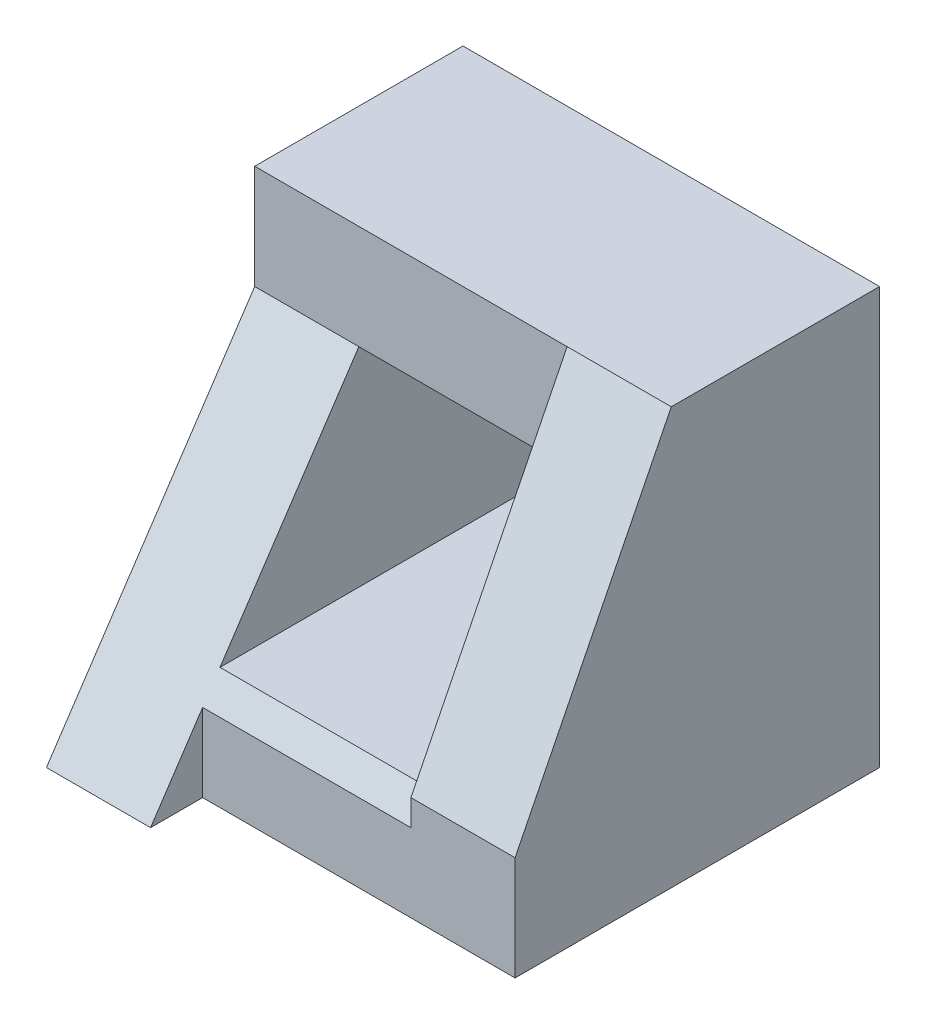
ISO-10303-21;
HEADER;
FILE_DESCRIPTION(('STEP AP214'),'2;1');
FILE_NAME('part.step','',(''),(''),'','','');
FILE_SCHEMA(('AUTOMOTIVE_DESIGN { 1 0 10303 214 1 1 1 1 }'));
ENDSEC;
DATA;
#1=APPLICATION_CONTEXT('core data for automotive mechanical design processes');
#2=APPLICATION_PROTOCOL_DEFINITION('international standard','automotive_design',2000,#1);
#3=PRODUCT_CONTEXT('',#1,'mechanical');
#4=PRODUCT('Part','Part','',(#3));
#5=PRODUCT_RELATED_PRODUCT_CATEGORY('part','',(#4));
#6=PRODUCT_DEFINITION_FORMATION('','',#4);
#7=PRODUCT_DEFINITION_CONTEXT('part definition',#1,'design');
#8=PRODUCT_DEFINITION('design','',#6,#7);
#9=PRODUCT_DEFINITION_SHAPE('','',#8);
#10=(LENGTH_UNIT() NAMED_UNIT(*) SI_UNIT(.MILLI.,.METRE.));
#11=(NAMED_UNIT(*) PLANE_ANGLE_UNIT() SI_UNIT($,.RADIAN.));
#12=(NAMED_UNIT(*) SI_UNIT($,.STERADIAN.) SOLID_ANGLE_UNIT());
#13=UNCERTAINTY_MEASURE_WITH_UNIT(LENGTH_MEASURE(1.E-05),#10,'distance_accuracy_value','');
#14=(GEOMETRIC_REPRESENTATION_CONTEXT(3) GLOBAL_UNCERTAINTY_ASSIGNED_CONTEXT((#13)) GLOBAL_UNIT_ASSIGNED_CONTEXT((#10,
#11,#12)) REPRESENTATION_CONTEXT('',''));
#15=CARTESIAN_POINT('',(0.,0.,0.));
#16=DIRECTION('',(0.,0.,1.));
#17=DIRECTION('',(1.,0.,0.));
#18=AXIS2_PLACEMENT_3D('',#15,#16,#17);
#19=CARTESIAN_POINT('',(0.,0.,0.));
#20=DIRECTION('',(0.,0.,-1.));
#21=DIRECTION('',(-1.,0.,0.));
#22=AXIS2_PLACEMENT_3D('',#19,#20,#21);
#23=PLANE('',#22);
#24=DIRECTION('',(0.,-1.,0.));
#25=VECTOR('',#24,1.);
#26=CARTESIAN_POINT('',(0.,0.,0.));
#27=LINE('',#26,#25);
#28=CARTESIAN_POINT('',(0.,4.,0.));
#29=VERTEX_POINT('',#28);
#30=CARTESIAN_POINT('',(0.,0.,0.));
#31=VERTEX_POINT('',#30);
#32=EDGE_CURVE('E194',#29,#31,#27,.T.);
#33=ORIENTED_EDGE('',*,*,#32,.F.);
#34=DIRECTION('',(-1.,0.,0.));
#35=VECTOR('',#34,1.);
#36=CARTESIAN_POINT('',(0.,4.,0.));
#37=LINE('',#36,#35);
#38=CARTESIAN_POINT('',(4.,4.,0.));
#39=VERTEX_POINT('',#38);
#40=EDGE_CURVE('E198',#39,#29,#37,.T.);
#41=ORIENTED_EDGE('',*,*,#40,.F.);
#42=DIRECTION('',(0.,1.,0.));
#43=VECTOR('',#42,1.);
#44=CARTESIAN_POINT('',(4.,0.,0.));
#45=LINE('',#44,#43);
#46=CARTESIAN_POINT('',(4.,0.,0.));
#47=VERTEX_POINT('',#46);
#48=EDGE_CURVE('E203',#47,#39,#45,.T.);
#49=ORIENTED_EDGE('',*,*,#48,.F.);
#50=DIRECTION('',(1.,0.,0.));
#51=VECTOR('',#50,1.);
#52=CARTESIAN_POINT('',(0.,0.,0.));
#53=LINE('',#52,#51);
#54=EDGE_CURVE('E201',#31,#47,#53,.T.);
#55=ORIENTED_EDGE('',*,*,#54,.F.);
#56=EDGE_LOOP('',(#33,#41,#49,#55));
#57=FACE_BOUND('',#56,.T.);
#58=DIRECTION('',(-1.,0.,0.));
#59=VECTOR('',#58,1.);
#60=CARTESIAN_POINT('',(1.,3.,0.));
#61=LINE('',#60,#59);
#62=CARTESIAN_POINT('',(3.,3.,0.));
#63=VERTEX_POINT('',#62);
#64=CARTESIAN_POINT('',(1.,3.,0.));
#65=VERTEX_POINT('',#64);
#66=EDGE_CURVE('E183',#63,#65,#61,.T.);
#67=ORIENTED_EDGE('',*,*,#66,.T.);
#68=DIRECTION('',(0.,-1.,0.));
#69=VECTOR('',#68,1.);
#70=CARTESIAN_POINT('',(1.,1.,0.));
#71=LINE('',#70,#69);
#72=CARTESIAN_POINT('',(1.,1.,0.));
#73=VERTEX_POINT('',#72);
#74=EDGE_CURVE('E174',#65,#73,#71,.T.);
#75=ORIENTED_EDGE('',*,*,#74,.T.);
#76=DIRECTION('',(1.,0.,0.));
#77=VECTOR('',#76,1.);
#78=CARTESIAN_POINT('',(1.,1.,0.));
#79=LINE('',#78,#77);
#80=CARTESIAN_POINT('',(3.,1.,0.));
#81=VERTEX_POINT('',#80);
#82=EDGE_CURVE('E177',#73,#81,#79,.T.);
#83=ORIENTED_EDGE('',*,*,#82,.T.);
#84=DIRECTION('',(0.,1.,0.));
#85=VECTOR('',#84,1.);
#86=CARTESIAN_POINT('',(3.,1.,0.));
#87=LINE('',#86,#85);
#88=EDGE_CURVE('E180',#81,#63,#87,.T.);
#89=ORIENTED_EDGE('',*,*,#88,.T.);
#90=EDGE_LOOP('',(#67,#75,#83,#89));
#91=FACE_BOUND('',#90,.T.);
#92=ADVANCED_FACE('F33',(#57,#91),#23,.T.);
#93=CARTESIAN_POINT('',(0.,0.,4.));
#94=DIRECTION('',(1.,0.,0.));
#95=DIRECTION('',(0.,0.,-1.));
#96=AXIS2_PLACEMENT_3D('',#93,#94,#95);
#97=PLANE('',#96);
#98=DIRECTION('',(0.,0.,-1.));
#99=VECTOR('',#98,1.);
#100=CARTESIAN_POINT('',(0.,0.,4.));
#101=LINE('',#100,#99);
#102=CARTESIAN_POINT('',(0.,0.,4.));
#103=VERTEX_POINT('',#102);
#104=EDGE_CURVE('E212',#103,#31,#101,.T.);
#105=ORIENTED_EDGE('',*,*,#104,.F.);
#106=DIRECTION('',(0.,-0.832050294337844,0.554700196225229));
#107=VECTOR('',#106,1.);
#108=CARTESIAN_POINT('',(0.,3.,2.));
#109=LINE('',#108,#107);
#110=CARTESIAN_POINT('',(0.,3.,2.));
#111=VERTEX_POINT('',#110);
#112=EDGE_CURVE('E147',#111,#103,#109,.T.);
#113=ORIENTED_EDGE('',*,*,#112,.F.);
#114=DIRECTION('',(0.,-1.,0.));
#115=VECTOR('',#114,1.);
#116=CARTESIAN_POINT('',(0.,4.,2.));
#117=LINE('',#116,#115);
#118=CARTESIAN_POINT('',(0.,4.,2.));
#119=VERTEX_POINT('',#118);
#120=EDGE_CURVE('E156',#119,#111,#117,.T.);
#121=ORIENTED_EDGE('',*,*,#120,.F.);
#122=DIRECTION('',(0.,0.,-1.));
#123=VECTOR('',#122,1.);
#124=CARTESIAN_POINT('',(0.,4.,4.));
#125=LINE('',#124,#123);
#126=EDGE_CURVE('E197',#119,#29,#125,.T.);
#127=ORIENTED_EDGE('',*,*,#126,.T.);
#128=ORIENTED_EDGE('',*,*,#32,.T.);
#129=EDGE_LOOP('',(#105,#113,#121,#127,#128));
#130=FACE_BOUND('',#129,.T.);
#131=ADVANCED_FACE('F35',(#130),#97,.F.);
#132=CARTESIAN_POINT('',(0.,0.,4.));
#133=DIRECTION('',(0.,1.,0.));
#134=DIRECTION('',(0.,0.,1.));
#135=AXIS2_PLACEMENT_3D('',#132,#133,#134);
#136=PLANE('',#135);
#137=DIRECTION('',(0.,0.,-1.));
#138=VECTOR('',#137,1.);
#139=CARTESIAN_POINT('',(4.,0.,4.));
#140=LINE('',#139,#138);
#141=CARTESIAN_POINT('',(4.,0.,3.5));
#142=VERTEX_POINT('',#141);
#143=EDGE_CURVE('E139',#142,#47,#140,.T.);
#144=ORIENTED_EDGE('',*,*,#143,.F.);
#145=DIRECTION('',(1.,0.,0.));
#146=VECTOR('',#145,1.);
#147=CARTESIAN_POINT('',(1.,0.,3.5));
#148=LINE('',#147,#146);
#149=CARTESIAN_POINT('',(1.,0.,3.5));
#150=VERTEX_POINT('',#149);
#151=EDGE_CURVE('E124',#150,#142,#148,.T.);
#152=ORIENTED_EDGE('',*,*,#151,.F.);
#153=DIRECTION('',(0.,0.,-1.));
#154=VECTOR('',#153,1.);
#155=CARTESIAN_POINT('',(1.,0.,4.));
#156=LINE('',#155,#154);
#157=CARTESIAN_POINT('',(1.,0.,4.));
#158=VERTEX_POINT('',#157);
#159=EDGE_CURVE('E127',#158,#150,#156,.T.);
#160=ORIENTED_EDGE('',*,*,#159,.F.);
#161=DIRECTION('',(1.,0.,0.));
#162=VECTOR('',#161,1.);
#163=CARTESIAN_POINT('',(0.,0.,4.));
#164=LINE('',#163,#162);
#165=EDGE_CURVE('E195',#103,#158,#164,.T.);
#166=ORIENTED_EDGE('',*,*,#165,.F.);
#167=ORIENTED_EDGE('',*,*,#104,.T.);
#168=ORIENTED_EDGE('',*,*,#54,.T.);
#169=EDGE_LOOP('',(#144,#152,#160,#166,#167,#168));
#170=FACE_BOUND('',#169,.T.);
#171=ADVANCED_FACE('F137',(#170),#136,.F.);
#172=CARTESIAN_POINT('',(4.,0.,4.));
#173=DIRECTION('',(-1.,0.,0.));
#174=DIRECTION('',(0.,0.,1.));
#175=AXIS2_PLACEMENT_3D('',#172,#173,#174);
#176=PLANE('',#175);
#177=DIRECTION('',(0.,0.894427190999916,-0.447213595499958));
#178=VECTOR('',#177,1.);
#179=CARTESIAN_POINT('',(4.,4.,2.));
#180=LINE('',#179,#178);
#181=CARTESIAN_POINT('',(4.,1.,3.5));
#182=VERTEX_POINT('',#181);
#183=CARTESIAN_POINT('',(4.,4.,2.));
#184=VERTEX_POINT('',#183);
#185=EDGE_CURVE('E56',#182,#184,#180,.T.);
#186=ORIENTED_EDGE('',*,*,#185,.F.);
#187=DIRECTION('',(0.,1.,0.));
#188=VECTOR('',#187,1.);
#189=CARTESIAN_POINT('',(4.,0.,3.5));
#190=LINE('',#189,#188);
#191=EDGE_CURVE('E134',#142,#182,#190,.T.);
#192=ORIENTED_EDGE('',*,*,#191,.F.);
#193=ORIENTED_EDGE('',*,*,#143,.T.);
#194=ORIENTED_EDGE('',*,*,#48,.T.);
#195=DIRECTION('',(0.,0.,-1.));
#196=VECTOR('',#195,1.);
#197=CARTESIAN_POINT('',(4.,4.,4.));
#198=LINE('',#197,#196);
#199=EDGE_CURVE('E209',#184,#39,#198,.T.);
#200=ORIENTED_EDGE('',*,*,#199,.F.);
#201=EDGE_LOOP('',(#186,#192,#193,#194,#200));
#202=FACE_BOUND('',#201,.T.);
#203=ADVANCED_FACE('F226',(#202),#176,.F.);
#204=CARTESIAN_POINT('',(0.,4.,4.));
#205=DIRECTION('',(0.,-1.,0.));
#206=DIRECTION('',(0.,0.,-1.));
#207=AXIS2_PLACEMENT_3D('',#204,#205,#206);
#208=PLANE('',#207);
#209=ORIENTED_EDGE('',*,*,#126,.F.);
#210=DIRECTION('',(1.,0.,0.));
#211=VECTOR('',#210,1.);
#212=CARTESIAN_POINT('',(0.,4.,2.));
#213=LINE('',#212,#211);
#214=CARTESIAN_POINT('',(3.,4.,2.));
#215=VERTEX_POINT('',#214);
#216=EDGE_CURVE('E168',#119,#215,#213,.T.);
#217=ORIENTED_EDGE('',*,*,#216,.T.);
#218=EDGE_CURVE('E167',#215,#184,#213,.T.);
#219=ORIENTED_EDGE('',*,*,#218,.T.);
#220=ORIENTED_EDGE('',*,*,#199,.T.);
#221=ORIENTED_EDGE('',*,*,#40,.T.);
#222=EDGE_LOOP('',(#209,#217,#219,#220,#221));
#223=FACE_BOUND('',#222,.T.);
#224=ADVANCED_FACE('F254',(#223),#208,.F.);
#225=CARTESIAN_POINT('',(1.,1.,4.));
#226=DIRECTION('',(1.,0.,0.));
#227=DIRECTION('',(0.,0.,-1.));
#228=AXIS2_PLACEMENT_3D('',#225,#226,#227);
#229=PLANE('',#228);
#230=DIRECTION('',(0.,0.832050294337844,-0.554700196225229));
#231=VECTOR('',#230,1.);
#232=CARTESIAN_POINT('',(1.,0.692307692307692,3.53846153846154));
#233=LINE('',#232,#231);
#234=CARTESIAN_POINT('',(1.,1.,3.33333333333333));
#235=VERTEX_POINT('',#234);
#236=CARTESIAN_POINT('',(1.,3.,2.));
#237=VERTEX_POINT('',#236);
#238=EDGE_CURVE('E154',#235,#237,#233,.T.);
#239=ORIENTED_EDGE('',*,*,#238,.F.);
#240=DIRECTION('',(0.,0.,-1.));
#241=VECTOR('',#240,1.);
#242=CARTESIAN_POINT('',(1.,1.,4.));
#243=LINE('',#242,#241);
#244=EDGE_CURVE('E192',#235,#73,#243,.T.);
#245=ORIENTED_EDGE('',*,*,#244,.T.);
#246=ORIENTED_EDGE('',*,*,#74,.F.);
#247=DIRECTION('',(0.,0.,-1.));
#248=VECTOR('',#247,1.);
#249=CARTESIAN_POINT('',(1.,3.,4.));
#250=LINE('',#249,#248);
#251=EDGE_CURVE('E186',#237,#65,#250,.T.);
#252=ORIENTED_EDGE('',*,*,#251,.F.);
#253=EDGE_LOOP('',(#239,#245,#246,#252));
#254=FACE_BOUND('',#253,.T.);
#255=ADVANCED_FACE('F243',(#254),#229,.T.);
#256=CARTESIAN_POINT('',(1.,1.,4.));
#257=DIRECTION('',(0.,1.,0.));
#258=DIRECTION('',(0.,0.,1.));
#259=AXIS2_PLACEMENT_3D('',#256,#257,#258);
#260=PLANE('',#259);
#261=DIRECTION('',(-1.,0.,0.));
#262=VECTOR('',#261,1.);
#263=CARTESIAN_POINT('',(1.,1.,3.33333333333333));
#264=LINE('',#263,#262);
#265=CARTESIAN_POINT('',(3.,1.,3.33333333333333));
#266=VERTEX_POINT('',#265);
#267=EDGE_CURVE('E151',#266,#235,#264,.T.);
#268=ORIENTED_EDGE('',*,*,#267,.F.);
#269=DIRECTION('',(0.,0.,-1.));
#270=VECTOR('',#269,1.);
#271=CARTESIAN_POINT('',(3.,1.,4.));
#272=LINE('',#271,#270);
#273=EDGE_CURVE('E190',#266,#81,#272,.T.);
#274=ORIENTED_EDGE('',*,*,#273,.T.);
#275=ORIENTED_EDGE('',*,*,#82,.F.);
#276=ORIENTED_EDGE('',*,*,#244,.F.);
#277=EDGE_LOOP('',(#268,#274,#275,#276));
#278=FACE_BOUND('',#277,.T.);
#279=ADVANCED_FACE('F250',(#278),#260,.T.);
#280=CARTESIAN_POINT('',(3.,1.,4.));
#281=DIRECTION('',(-1.,0.,0.));
#282=DIRECTION('',(0.,0.,1.));
#283=AXIS2_PLACEMENT_3D('',#280,#281,#282);
#284=PLANE('',#283);
#285=DIRECTION('',(0.,-1.,0.));
#286=VECTOR('',#285,1.);
#287=CARTESIAN_POINT('',(3.,1.,3.5));
#288=LINE('',#287,#286);
#289=CARTESIAN_POINT('',(3.,1.,3.5));
#290=VERTEX_POINT('',#289);
#291=CARTESIAN_POINT('',(3.,0.75,3.5));
#292=VERTEX_POINT('',#291);
#293=EDGE_CURVE('E142',#290,#292,#288,.T.);
#294=ORIENTED_EDGE('',*,*,#293,.F.);
#295=DIRECTION('',(0.,-0.894427190999916,0.447213595499958));
#296=VECTOR('',#295,1.);
#297=CARTESIAN_POINT('',(3.,0.8,3.6));
#298=LINE('',#297,#296);
#299=EDGE_CURVE('E171',#215,#290,#298,.T.);
#300=ORIENTED_EDGE('',*,*,#299,.F.);
#301=DIRECTION('',(0.,-1.,0.));
#302=VECTOR('',#301,1.);
#303=CARTESIAN_POINT('',(3.,4.,2.));
#304=LINE('',#303,#302);
#305=CARTESIAN_POINT('',(3.,3.,2.));
#306=VERTEX_POINT('',#305);
#307=EDGE_CURVE('E157',#215,#306,#304,.T.);
#308=ORIENTED_EDGE('',*,*,#307,.T.);
#309=DIRECTION('',(0.,0.,-1.));
#310=VECTOR('',#309,1.);
#311=CARTESIAN_POINT('',(3.,3.,4.));
#312=LINE('',#311,#310);
#313=EDGE_CURVE('E188',#306,#63,#312,.T.);
#314=ORIENTED_EDGE('',*,*,#313,.T.);
#315=ORIENTED_EDGE('',*,*,#88,.F.);
#316=ORIENTED_EDGE('',*,*,#273,.F.);
#317=DIRECTION('',(0.,-0.832050294337844,0.554700196225229));
#318=VECTOR('',#317,1.);
#319=CARTESIAN_POINT('',(3.,3.,2.));
#320=LINE('',#319,#318);
#321=EDGE_CURVE('E148',#266,#292,#320,.T.);
#322=ORIENTED_EDGE('',*,*,#321,.T.);
#323=EDGE_LOOP('',(#294,#300,#308,#314,#315,#316,#322));
#324=FACE_BOUND('',#323,.T.);
#325=ADVANCED_FACE('F231',(#324),#284,.T.);
#326=CARTESIAN_POINT('',(1.,3.,4.));
#327=DIRECTION('',(0.,-1.,0.));
#328=DIRECTION('',(0.,0.,-1.));
#329=AXIS2_PLACEMENT_3D('',#326,#327,#328);
#330=PLANE('',#329);
#331=DIRECTION('',(-1.,0.,0.));
#332=VECTOR('',#331,1.);
#333=CARTESIAN_POINT('',(3.,3.,2.));
#334=LINE('',#333,#332);
#335=EDGE_CURVE('E163',#306,#237,#334,.T.);
#336=ORIENTED_EDGE('',*,*,#335,.T.);
#337=ORIENTED_EDGE('',*,*,#251,.T.);
#338=ORIENTED_EDGE('',*,*,#66,.F.);
#339=ORIENTED_EDGE('',*,*,#313,.F.);
#340=EDGE_LOOP('',(#336,#337,#338,#339));
#341=FACE_BOUND('',#340,.T.);
#342=ADVANCED_FACE('F238',(#341),#330,.T.);
#343=CARTESIAN_POINT('',(0.,4.,2.));
#344=DIRECTION('',(0.,-0.447213595499958,-0.894427190999916));
#345=DIRECTION('',(0.,0.894427190999916,-0.447213595499958));
#346=AXIS2_PLACEMENT_3D('',#343,#344,#345);
#347=PLANE('',#346);
#348=ORIENTED_EDGE('',*,*,#299,.T.);
#349=DIRECTION('',(1.,0.,0.));
#350=VECTOR('',#349,1.);
#351=CARTESIAN_POINT('',(1.,1.,3.5));
#352=LINE('',#351,#350);
#353=EDGE_CURVE('E140',#290,#182,#352,.T.);
#354=ORIENTED_EDGE('',*,*,#353,.T.);
#355=ORIENTED_EDGE('',*,*,#185,.T.);
#356=ORIENTED_EDGE('',*,*,#218,.F.);
#357=EDGE_LOOP('',(#348,#354,#355,#356));
#358=FACE_BOUND('',#357,.T.);
#359=ADVANCED_FACE('F228',(#358),#347,.F.);
#360=CARTESIAN_POINT('',(3.,4.,2.));
#361=DIRECTION('',(0.,0.,-1.));
#362=DIRECTION('',(-1.,0.,0.));
#363=AXIS2_PLACEMENT_3D('',#360,#361,#362);
#364=PLANE('',#363);
#365=ORIENTED_EDGE('',*,*,#120,.T.);
#366=EDGE_CURVE('E160',#237,#111,#334,.T.);
#367=ORIENTED_EDGE('',*,*,#366,.F.);
#368=ORIENTED_EDGE('',*,*,#335,.F.);
#369=ORIENTED_EDGE('',*,*,#307,.F.);
#370=ORIENTED_EDGE('',*,*,#216,.F.);
#371=EDGE_LOOP('',(#365,#367,#368,#369,#370));
#372=FACE_BOUND('',#371,.T.);
#373=ADVANCED_FACE('F234',(#372),#364,.F.);
#374=CARTESIAN_POINT('',(3.,3.,2.));
#375=DIRECTION('',(0.,-0.554700196225229,-0.832050294337844));
#376=DIRECTION('',(0.,0.832050294337844,-0.554700196225229));
#377=AXIS2_PLACEMENT_3D('',#374,#375,#376);
#378=PLANE('',#377);
#379=DIRECTION('',(0.,-0.832050294337844,0.554700196225229));
#380=VECTOR('',#379,1.);
#381=CARTESIAN_POINT('',(1.,3.,2.));
#382=LINE('',#381,#380);
#383=CARTESIAN_POINT('',(1.,0.75,3.5));
#384=VERTEX_POINT('',#383);
#385=EDGE_CURVE('E41',#384,#158,#382,.T.);
#386=ORIENTED_EDGE('',*,*,#385,.F.);
#387=DIRECTION('',(1.,0.,0.));
#388=VECTOR('',#387,1.);
#389=CARTESIAN_POINT('',(3.,0.75,3.5));
#390=LINE('',#389,#388);
#391=EDGE_CURVE('E11',#384,#292,#390,.T.);
#392=ORIENTED_EDGE('',*,*,#391,.T.);
#393=ORIENTED_EDGE('',*,*,#321,.F.);
#394=ORIENTED_EDGE('',*,*,#267,.T.);
#395=ORIENTED_EDGE('',*,*,#238,.T.);
#396=ORIENTED_EDGE('',*,*,#366,.T.);
#397=ORIENTED_EDGE('',*,*,#112,.T.);
#398=ORIENTED_EDGE('',*,*,#165,.T.);
#399=EDGE_LOOP('',(#386,#392,#393,#394,#395,#396,#397,#398));
#400=FACE_BOUND('',#399,.T.);
#401=ADVANCED_FACE('F252',(#400),#378,.F.);
#402=CARTESIAN_POINT('',(1.,0.,0.));
#403=DIRECTION('',(1.,0.,0.));
#404=DIRECTION('',(0.,0.,-1.));
#405=AXIS2_PLACEMENT_3D('',#402,#403,#404);
#406=PLANE('',#405);
#407=ORIENTED_EDGE('',*,*,#385,.T.);
#408=ORIENTED_EDGE('',*,*,#159,.T.);
#409=DIRECTION('',(0.,1.,0.));
#410=VECTOR('',#409,1.);
#411=CARTESIAN_POINT('',(1.,0.,3.5));
#412=LINE('',#411,#410);
#413=EDGE_CURVE('E48',#150,#384,#412,.T.);
#414=ORIENTED_EDGE('',*,*,#413,.T.);
#415=EDGE_LOOP('',(#407,#408,#414));
#416=FACE_BOUND('',#415,.T.);
#417=ADVANCED_FACE('F130',(#416),#406,.T.);
#418=CARTESIAN_POINT('',(1.,0.,3.5));
#419=DIRECTION('',(0.,0.,-1.));
#420=DIRECTION('',(-1.,0.,0.));
#421=AXIS2_PLACEMENT_3D('',#418,#419,#420);
#422=PLANE('',#421);
#423=ORIENTED_EDGE('',*,*,#293,.T.);
#424=ORIENTED_EDGE('',*,*,#391,.F.);
#425=ORIENTED_EDGE('',*,*,#413,.F.);
#426=ORIENTED_EDGE('',*,*,#151,.T.);
#427=ORIENTED_EDGE('',*,*,#191,.T.);
#428=ORIENTED_EDGE('',*,*,#353,.F.);
#429=EDGE_LOOP('',(#423,#424,#425,#426,#427,#428));
#430=FACE_BOUND('',#429,.T.);
#431=ADVANCED_FACE('F122',(#430),#422,.F.);
#432=CLOSED_SHELL('',(#92,#131,#171,#203,#224,#255,#279,#325,#342,#359,#373,#401,#417,#431));
#433=MANIFOLD_SOLID_BREP('B2',#432);
#434=ADVANCED_BREP_SHAPE_REPRESENTATION('',(#18,#433),#14);
#435=SHAPE_DEFINITION_REPRESENTATION(#9,#434);
ENDSEC;
END-ISO-10303-21;
